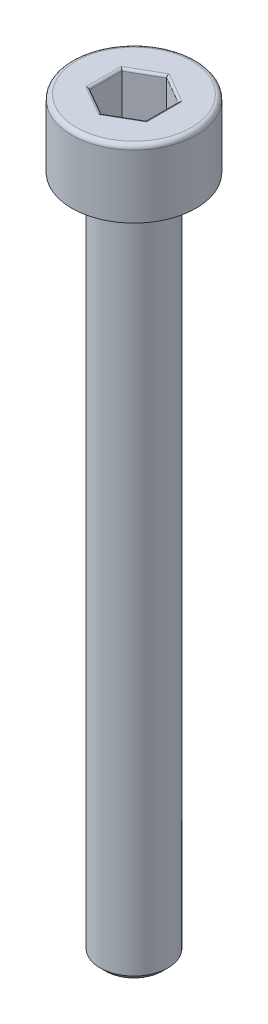
ISO-10303-21;
HEADER;
FILE_DESCRIPTION(('STEP AP214'),'2;1');
FILE_NAME('part.step','',(''),(''),'','','');
FILE_SCHEMA(('AUTOMOTIVE_DESIGN { 1 0 10303 214 1 1 1 1 }'));
ENDSEC;
DATA;
#1=APPLICATION_CONTEXT('core data for automotive mechanical design processes');
#2=APPLICATION_PROTOCOL_DEFINITION('international standard','automotive_design',2000,#1);
#3=PRODUCT_CONTEXT('',#1,'mechanical');
#4=PRODUCT('Part','Part','',(#3));
#5=PRODUCT_RELATED_PRODUCT_CATEGORY('part','',(#4));
#6=PRODUCT_DEFINITION_FORMATION('','',#4);
#7=PRODUCT_DEFINITION_CONTEXT('part definition',#1,'design');
#8=PRODUCT_DEFINITION('design','',#6,#7);
#9=PRODUCT_DEFINITION_SHAPE('','',#8);
#10=(LENGTH_UNIT() NAMED_UNIT(*) SI_UNIT(.MILLI.,.METRE.));
#11=(NAMED_UNIT(*) PLANE_ANGLE_UNIT() SI_UNIT($,.RADIAN.));
#12=(NAMED_UNIT(*) SI_UNIT($,.STERADIAN.) SOLID_ANGLE_UNIT());
#13=UNCERTAINTY_MEASURE_WITH_UNIT(LENGTH_MEASURE(1.E-05),#10,'distance_accuracy_value','');
#14=(GEOMETRIC_REPRESENTATION_CONTEXT(3) GLOBAL_UNCERTAINTY_ASSIGNED_CONTEXT((#13)) GLOBAL_UNIT_ASSIGNED_CONTEXT((#10,
#11,#12)) REPRESENTATION_CONTEXT('',''));
#15=CARTESIAN_POINT('',(0.,0.,0.));
#16=DIRECTION('',(0.,0.,1.));
#17=DIRECTION('',(1.,0.,0.));
#18=AXIS2_PLACEMENT_3D('',#15,#16,#17);
#19=CARTESIAN_POINT('',(0.,-33.,0.));
#20=DIRECTION('',(0.,-1.,0.));
#21=DIRECTION('',(0.,0.,-1.));
#22=AXIS2_PLACEMENT_3D('',#19,#20,#21);
#23=PLANE('',#22);
#24=CARTESIAN_POINT('',(0.,-33.,0.));
#25=DIRECTION('',(0.,-1.,0.));
#26=DIRECTION('',(0.,0.,-1.));
#27=AXIS2_PLACEMENT_3D('',#24,#25,#26);
#28=CIRCLE('',#27,1.24999999999999);
#29=CARTESIAN_POINT('',(0.,-33.,-1.24999999999999));
#30=VERTEX_POINT('',#29);
#31=EDGE_CURVE('E261',#30,#30,#28,.T.);
#32=ORIENTED_EDGE('',*,*,#31,.T.);
#33=EDGE_LOOP('',(#32));
#34=FACE_BOUND('',#33,.T.);
#35=ADVANCED_FACE('F33',(#34),#23,.T.);
#36=CARTESIAN_POINT('',(0.,0.,0.));
#37=DIRECTION('',(0.,1.,0.));
#38=DIRECTION('',(0.,0.,1.));
#39=AXIS2_PLACEMENT_3D('',#36,#37,#38);
#40=CYLINDRICAL_SURFACE('',#39,1.5);
#41=CARTESIAN_POINT('',(0.,-3.25,0.));
#42=DIRECTION('',(0.,-1.,0.));
#43=DIRECTION('',(0.,0.,-1.));
#44=AXIS2_PLACEMENT_3D('',#41,#42,#43);
#45=CIRCLE('',#44,1.5);
#46=CARTESIAN_POINT('',(0.,-3.25,-1.5));
#47=VERTEX_POINT('',#46);
#48=EDGE_CURVE('E258',#47,#47,#45,.T.);
#49=ORIENTED_EDGE('',*,*,#48,.T.);
#50=EDGE_LOOP('',(#49));
#51=FACE_BOUND('',#50,.T.);
#52=CARTESIAN_POINT('',(0.,-32.75,0.));
#53=DIRECTION('',(0.,-1.,0.));
#54=DIRECTION('',(0.,0.,-1.));
#55=AXIS2_PLACEMENT_3D('',#52,#53,#54);
#56=CIRCLE('',#55,1.5);
#57=CARTESIAN_POINT('',(0.,-32.75,-1.5));
#58=VERTEX_POINT('',#57);
#59=EDGE_CURVE('E255',#58,#58,#56,.F.);
#60=ORIENTED_EDGE('',*,*,#59,.T.);
#61=EDGE_LOOP('',(#60));
#62=FACE_BOUND('',#61,.T.);
#63=ADVANCED_FACE('F287',(#51,#62),#40,.T.);
#64=CARTESIAN_POINT('',(-1.5,-3.,0.));
#65=DIRECTION('',(0.,-1.,0.));
#66=DIRECTION('',(0.,0.,-1.));
#67=AXIS2_PLACEMENT_3D('',#64,#65,#66);
#68=PLANE('',#67);
#69=CARTESIAN_POINT('',(0.,-3.,0.));
#70=DIRECTION('',(0.,-1.,0.));
#71=DIRECTION('',(0.,0.,-1.));
#72=AXIS2_PLACEMENT_3D('',#69,#70,#71);
#73=CIRCLE('',#72,1.75);
#74=CARTESIAN_POINT('',(0.,-3.,-1.75));
#75=VERTEX_POINT('',#74);
#76=EDGE_CURVE('E252',#75,#75,#73,.F.);
#77=ORIENTED_EDGE('',*,*,#76,.T.);
#78=EDGE_LOOP('',(#77));
#79=FACE_BOUND('',#78,.T.);
#80=CARTESIAN_POINT('',(0.,-3.,0.));
#81=DIRECTION('',(0.,1.,0.));
#82=DIRECTION('',(0.,0.,1.));
#83=AXIS2_PLACEMENT_3D('',#80,#81,#82);
#84=CIRCLE('',#83,2.75);
#85=CARTESIAN_POINT('',(0.,-3.,2.75));
#86=VERTEX_POINT('',#85);
#87=EDGE_CURVE('E249',#86,#86,#84,.T.);
#88=ORIENTED_EDGE('',*,*,#87,.F.);
#89=EDGE_LOOP('',(#88));
#90=FACE_BOUND('',#89,.T.);
#91=ADVANCED_FACE('F293',(#79,#90),#68,.T.);
#92=CARTESIAN_POINT('',(0.,0.,0.));
#93=DIRECTION('',(0.,1.,0.));
#94=DIRECTION('',(0.,0.,1.));
#95=AXIS2_PLACEMENT_3D('',#92,#93,#94);
#96=CYLINDRICAL_SURFACE('',#95,2.75);
#97=CARTESIAN_POINT('',(0.,-0.2,0.));
#98=DIRECTION('',(0.,1.,0.));
#99=DIRECTION('',(0.,0.,1.));
#100=AXIS2_PLACEMENT_3D('',#97,#98,#99);
#101=CIRCLE('',#100,2.75);
#102=CARTESIAN_POINT('',(0.,-0.2,2.75));
#103=VERTEX_POINT('',#102);
#104=EDGE_CURVE('E159',#103,#103,#101,.F.);
#105=ORIENTED_EDGE('',*,*,#104,.T.);
#106=EDGE_LOOP('',(#105));
#107=FACE_BOUND('',#106,.T.);
#108=ORIENTED_EDGE('',*,*,#87,.T.);
#109=EDGE_LOOP('',(#108));
#110=FACE_BOUND('',#109,.T.);
#111=ADVANCED_FACE('F303',(#107,#110),#96,.T.);
#112=CARTESIAN_POINT('',(-2.75,0.,0.));
#113=DIRECTION('',(0.,1.,0.));
#114=DIRECTION('',(0.,0.,1.));
#115=AXIS2_PLACEMENT_3D('',#112,#113,#114);
#116=PLANE('',#115);
#117=DIRECTION('',(0.,0.,1.));
#118=VECTOR('',#117,1.);
#119=CARTESIAN_POINT('',(-1.35,0.,-0.721687836487033));
#120=LINE('',#119,#118);
#121=CARTESIAN_POINT('',(-1.35,0.,0.779422863405995));
#122=VERTEX_POINT('',#121);
#123=CARTESIAN_POINT('',(-1.35,0.,-0.779422863405995));
#124=VERTEX_POINT('',#123);
#125=EDGE_CURVE('E175',#122,#124,#120,.F.);
#126=ORIENTED_EDGE('',*,*,#125,.T.);
#127=DIRECTION('',(-0.866025403784439,0.,0.5));
#128=VECTOR('',#127,1.);
#129=CARTESIAN_POINT('',(-0.0500000000000002,0.,-1.52997821335251));
#130=LINE('',#129,#128);
#131=CARTESIAN_POINT('',(0.,0.,-1.55884572681199));
#132=VERTEX_POINT('',#131);
#133=EDGE_CURVE('E134',#124,#132,#130,.F.);
#134=ORIENTED_EDGE('',*,*,#133,.T.);
#135=DIRECTION('',(-0.866025403784439,0.,-0.5));
#136=VECTOR('',#135,1.);
#137=CARTESIAN_POINT('',(1.3,0.,-0.808290376865477));
#138=LINE('',#137,#136);
#139=CARTESIAN_POINT('',(1.35,0.,-0.779422863405995));
#140=VERTEX_POINT('',#139);
#141=EDGE_CURVE('E161',#132,#140,#138,.F.);
#142=ORIENTED_EDGE('',*,*,#141,.T.);
#143=DIRECTION('',(0.,0.,-1.));
#144=VECTOR('',#143,1.);
#145=CARTESIAN_POINT('',(1.35,0.,0.721687836487034));
#146=LINE('',#145,#144);
#147=CARTESIAN_POINT('',(1.35,0.,0.779422863405996));
#148=VERTEX_POINT('',#147);
#149=EDGE_CURVE('E169',#140,#148,#146,.F.);
#150=ORIENTED_EDGE('',*,*,#149,.T.);
#151=DIRECTION('',(0.866025403784439,0.,-0.5));
#152=VECTOR('',#151,1.);
#153=CARTESIAN_POINT('',(0.05,0.,1.52997821335251));
#154=LINE('',#153,#152);
#155=CARTESIAN_POINT('',(0.,0.,1.55884572681199));
#156=VERTEX_POINT('',#155);
#157=EDGE_CURVE('E171',#148,#156,#154,.F.);
#158=ORIENTED_EDGE('',*,*,#157,.T.);
#159=DIRECTION('',(0.866025403784438,0.,0.5));
#160=VECTOR('',#159,1.);
#161=CARTESIAN_POINT('',(-1.3,0.,0.808290376865476));
#162=LINE('',#161,#160);
#163=EDGE_CURVE('E173',#156,#122,#162,.F.);
#164=ORIENTED_EDGE('',*,*,#163,.T.);
#165=EDGE_LOOP('',(#126,#134,#142,#150,#158,#164));
#166=FACE_BOUND('',#165,.T.);
#167=CARTESIAN_POINT('',(0.,0.,0.));
#168=DIRECTION('',(0.,1.,0.));
#169=DIRECTION('',(0.,0.,1.));
#170=AXIS2_PLACEMENT_3D('',#167,#168,#169);
#171=CIRCLE('',#170,2.55);
#172=CARTESIAN_POINT('',(0.,0.,2.55));
#173=VERTEX_POINT('',#172);
#174=EDGE_CURVE('E164',#173,#173,#171,.T.);
#175=ORIENTED_EDGE('',*,*,#174,.T.);
#176=EDGE_LOOP('',(#175));
#177=FACE_BOUND('',#176,.T.);
#178=ADVANCED_FACE('F266',(#166,#177),#116,.T.);
#179=CARTESIAN_POINT('',(0.,-3.,0.));
#180=DIRECTION('',(0.,1.,0.));
#181=DIRECTION('',(0.,0.,1.));
#182=AXIS2_PLACEMENT_3D('',#179,#180,#181);
#183=CONICAL_SURFACE('',#182,1.75,0.785398163397445);
#184=ORIENTED_EDGE('',*,*,#48,.F.);
#185=EDGE_LOOP('',(#184));
#186=FACE_BOUND('',#185,.T.);
#187=ORIENTED_EDGE('',*,*,#76,.F.);
#188=EDGE_LOOP('',(#187));
#189=FACE_BOUND('',#188,.T.);
#190=ADVANCED_FACE('F281',(#186,#189),#183,.T.);
#191=CARTESIAN_POINT('',(0.,-32.75,0.));
#192=DIRECTION('',(0.,1.,0.));
#193=DIRECTION('',(0.,0.,1.));
#194=AXIS2_PLACEMENT_3D('',#191,#192,#193);
#195=CONICAL_SURFACE('',#194,1.5,0.785398163397458);
#196=ORIENTED_EDGE('',*,*,#31,.F.);
#197=EDGE_LOOP('',(#196));
#198=FACE_BOUND('',#197,.T.);
#199=ORIENTED_EDGE('',*,*,#59,.F.);
#200=EDGE_LOOP('',(#199));
#201=FACE_BOUND('',#200,.T.);
#202=ADVANCED_FACE('F271',(#198,#201),#195,.T.);
#203=CARTESIAN_POINT('',(0.,-0.2,0.));
#204=DIRECTION('',(0.,1.,0.));
#205=DIRECTION('',(0.,0.,1.));
#206=AXIS2_PLACEMENT_3D('',#203,#204,#205);
#207=TOROIDAL_SURFACE('',#206,2.55,0.2);
#208=ORIENTED_EDGE('',*,*,#104,.F.);
#209=EDGE_LOOP('',(#208));
#210=FACE_BOUND('',#209,.T.);
#211=ORIENTED_EDGE('',*,*,#174,.F.);
#212=EDGE_LOOP('',(#211));
#213=FACE_BOUND('',#212,.T.);
#214=ADVANCED_FACE('F268',(#210,#213),#207,.T.);
#215=CARTESIAN_POINT('',(1.25,-2.,-0.721687836487033));
#216=DIRECTION('',(0.5,0.,-0.866025403784439));
#217=DIRECTION('',(-0.866025403784439,0.,-0.5));
#218=AXIS2_PLACEMENT_3D('',#215,#216,#217);
#219=PLANE('',#218);
#220=DIRECTION('',(0.,1.,0.));
#221=VECTOR('',#220,1.);
#222=CARTESIAN_POINT('',(1.25,-2.,-0.721687836487033));
#223=LINE('',#222,#221);
#224=CARTESIAN_POINT('',(1.25,-1.9,-0.721687836487033));
#225=VERTEX_POINT('',#224);
#226=CARTESIAN_POINT('',(1.25,-0.1,-0.721687836487033));
#227=VERTEX_POINT('',#226);
#228=EDGE_CURVE('E243',#225,#227,#223,.T.);
#229=ORIENTED_EDGE('',*,*,#228,.T.);
#230=DIRECTION('',(-0.866025403784439,0.,-0.5));
#231=VECTOR('',#230,1.);
#232=CARTESIAN_POINT('',(0.,-0.1,-1.44337567297406));
#233=LINE('',#232,#231);
#234=CARTESIAN_POINT('',(0.,-0.1,-1.44337567297406));
#235=VERTEX_POINT('',#234);
#236=EDGE_CURVE('E195',#227,#235,#233,.T.);
#237=ORIENTED_EDGE('',*,*,#236,.T.);
#238=DIRECTION('',(0.,1.,0.));
#239=VECTOR('',#238,1.);
#240=CARTESIAN_POINT('',(0.,-2.,-1.44337567297406));
#241=LINE('',#240,#239);
#242=CARTESIAN_POINT('',(0.,-1.9,-1.44337567297406));
#243=VERTEX_POINT('',#242);
#244=EDGE_CURVE('E145',#243,#235,#241,.T.);
#245=ORIENTED_EDGE('',*,*,#244,.F.);
#246=DIRECTION('',(-0.866025403784439,0.,-0.5));
#247=VECTOR('',#246,1.);
#248=CARTESIAN_POINT('',(1.25,-1.9,-0.721687836487033));
#249=LINE('',#248,#247);
#250=EDGE_CURVE('E193',#243,#225,#249,.F.);
#251=ORIENTED_EDGE('',*,*,#250,.T.);
#252=EDGE_LOOP('',(#229,#237,#245,#251));
#253=FACE_BOUND('',#252,.T.);
#254=ADVANCED_FACE('F270',(#253),#219,.F.);
#255=CARTESIAN_POINT('',(1.25,-2.,0.721687836487034));
#256=DIRECTION('',(1.,0.,0.));
#257=DIRECTION('',(0.,0.,-1.));
#258=AXIS2_PLACEMENT_3D('',#255,#256,#257);
#259=PLANE('',#258);
#260=DIRECTION('',(0.,1.,0.));
#261=VECTOR('',#260,1.);
#262=CARTESIAN_POINT('',(1.25,-2.,0.721687836487034));
#263=LINE('',#262,#261);
#264=CARTESIAN_POINT('',(1.25,-1.9,0.721687836487034));
#265=VERTEX_POINT('',#264);
#266=CARTESIAN_POINT('',(1.25,-0.1,0.721687836487034));
#267=VERTEX_POINT('',#266);
#268=EDGE_CURVE('E240',#265,#267,#263,.T.);
#269=ORIENTED_EDGE('',*,*,#268,.T.);
#270=DIRECTION('',(0.,0.,-1.));
#271=VECTOR('',#270,1.);
#272=CARTESIAN_POINT('',(1.25,-0.1,-0.721687836487033));
#273=LINE('',#272,#271);
#274=EDGE_CURVE('E191',#267,#227,#273,.T.);
#275=ORIENTED_EDGE('',*,*,#274,.T.);
#276=ORIENTED_EDGE('',*,*,#228,.F.);
#277=DIRECTION('',(0.,0.,-1.));
#278=VECTOR('',#277,1.);
#279=CARTESIAN_POINT('',(1.25,-1.9,0.721687836487034));
#280=LINE('',#279,#278);
#281=EDGE_CURVE('E188',#225,#265,#280,.F.);
#282=ORIENTED_EDGE('',*,*,#281,.T.);
#283=EDGE_LOOP('',(#269,#275,#276,#282));
#284=FACE_BOUND('',#283,.T.);
#285=ADVANCED_FACE('F278',(#284),#259,.F.);
#286=CARTESIAN_POINT('',(0.,-2.,1.44337567297407));
#287=DIRECTION('',(0.5,0.,0.866025403784439));
#288=DIRECTION('',(0.866025403784439,0.,-0.5));
#289=AXIS2_PLACEMENT_3D('',#286,#287,#288);
#290=PLANE('',#289);
#291=DIRECTION('',(0.,1.,0.));
#292=VECTOR('',#291,1.);
#293=CARTESIAN_POINT('',(0.,-2.,1.44337567297407));
#294=LINE('',#293,#292);
#295=CARTESIAN_POINT('',(0.,-1.9,1.44337567297407));
#296=VERTEX_POINT('',#295);
#297=CARTESIAN_POINT('',(0.,-0.1,1.44337567297407));
#298=VERTEX_POINT('',#297);
#299=EDGE_CURVE('E237',#296,#298,#294,.T.);
#300=ORIENTED_EDGE('',*,*,#299,.T.);
#301=DIRECTION('',(0.866025403784439,0.,-0.5));
#302=VECTOR('',#301,1.);
#303=CARTESIAN_POINT('',(1.25,-0.1,0.721687836487034));
#304=LINE('',#303,#302);
#305=EDGE_CURVE('E186',#298,#267,#304,.T.);
#306=ORIENTED_EDGE('',*,*,#305,.T.);
#307=ORIENTED_EDGE('',*,*,#268,.F.);
#308=DIRECTION('',(0.866025403784439,0.,-0.5));
#309=VECTOR('',#308,1.);
#310=CARTESIAN_POINT('',(0.,-1.9,1.44337567297407));
#311=LINE('',#310,#309);
#312=EDGE_CURVE('E184',#265,#296,#311,.F.);
#313=ORIENTED_EDGE('',*,*,#312,.T.);
#314=EDGE_LOOP('',(#300,#306,#307,#313));
#315=FACE_BOUND('',#314,.T.);
#316=ADVANCED_FACE('F327',(#315),#290,.F.);
#317=CARTESIAN_POINT('',(-1.25,-2.,0.721687836487033));
#318=DIRECTION('',(-0.5,0.,0.866025403784439));
#319=DIRECTION('',(0.866025403784438,0.,0.5));
#320=AXIS2_PLACEMENT_3D('',#317,#318,#319);
#321=PLANE('',#320);
#322=DIRECTION('',(0.,1.,0.));
#323=VECTOR('',#322,1.);
#324=CARTESIAN_POINT('',(-1.25,-2.,0.721687836487033));
#325=LINE('',#324,#323);
#326=CARTESIAN_POINT('',(-1.25,-1.9,0.721687836487033));
#327=VERTEX_POINT('',#326);
#328=CARTESIAN_POINT('',(-1.25,-0.1,0.721687836487033));
#329=VERTEX_POINT('',#328);
#330=EDGE_CURVE('E128',#327,#329,#325,.T.);
#331=ORIENTED_EDGE('',*,*,#330,.T.);
#332=DIRECTION('',(0.866025403784438,0.,0.5));
#333=VECTOR('',#332,1.);
#334=CARTESIAN_POINT('',(0.,-0.1,1.44337567297407));
#335=LINE('',#334,#333);
#336=EDGE_CURVE('E182',#329,#298,#335,.T.);
#337=ORIENTED_EDGE('',*,*,#336,.T.);
#338=ORIENTED_EDGE('',*,*,#299,.F.);
#339=DIRECTION('',(0.866025403784438,0.,0.5));
#340=VECTOR('',#339,1.);
#341=CARTESIAN_POINT('',(-1.25,-1.9,0.721687836487033));
#342=LINE('',#341,#340);
#343=EDGE_CURVE('E180',#296,#327,#342,.F.);
#344=ORIENTED_EDGE('',*,*,#343,.T.);
#345=EDGE_LOOP('',(#331,#337,#338,#344));
#346=FACE_BOUND('',#345,.T.);
#347=ADVANCED_FACE('F234',(#346),#321,.F.);
#348=CARTESIAN_POINT('',(-1.25,-2.,-0.721687836487033));
#349=DIRECTION('',(-1.,0.,0.));
#350=DIRECTION('',(0.,0.,1.));
#351=AXIS2_PLACEMENT_3D('',#348,#349,#350);
#352=PLANE('',#351);
#353=DIRECTION('',(0.,1.,0.));
#354=VECTOR('',#353,1.);
#355=CARTESIAN_POINT('',(-1.25,-2.,-0.721687836487033));
#356=LINE('',#355,#354);
#357=CARTESIAN_POINT('',(-1.25,-1.9,-0.721687836487033));
#358=VERTEX_POINT('',#357);
#359=CARTESIAN_POINT('',(-1.25,-0.1,-0.721687836487033));
#360=VERTEX_POINT('',#359);
#361=EDGE_CURVE('E126',#358,#360,#356,.T.);
#362=ORIENTED_EDGE('',*,*,#361,.T.);
#363=DIRECTION('',(0.,0.,1.));
#364=VECTOR('',#363,1.);
#365=CARTESIAN_POINT('',(-1.25,-0.1,0.721687836487033));
#366=LINE('',#365,#364);
#367=EDGE_CURVE('E133',#360,#329,#366,.T.);
#368=ORIENTED_EDGE('',*,*,#367,.T.);
#369=ORIENTED_EDGE('',*,*,#330,.F.);
#370=DIRECTION('',(0.,0.,1.));
#371=VECTOR('',#370,1.);
#372=CARTESIAN_POINT('',(-1.25,-1.9,-0.721687836487033));
#373=LINE('',#372,#371);
#374=EDGE_CURVE('E123',#327,#358,#373,.F.);
#375=ORIENTED_EDGE('',*,*,#374,.T.);
#376=EDGE_LOOP('',(#362,#368,#369,#375));
#377=FACE_BOUND('',#376,.T.);
#378=ADVANCED_FACE('F125',(#377),#352,.F.);
#379=CARTESIAN_POINT('',(0.,-2.,-1.44337567297406));
#380=DIRECTION('',(-0.5,0.,-0.866025403784439));
#381=DIRECTION('',(-0.866025403784439,0.,0.5));
#382=AXIS2_PLACEMENT_3D('',#379,#380,#381);
#383=PLANE('',#382);
#384=ORIENTED_EDGE('',*,*,#244,.T.);
#385=DIRECTION('',(-0.866025403784439,0.,0.5));
#386=VECTOR('',#385,1.);
#387=CARTESIAN_POINT('',(-1.25,-0.1,-0.721687836487032));
#388=LINE('',#387,#386);
#389=EDGE_CURVE('E144',#235,#360,#388,.T.);
#390=ORIENTED_EDGE('',*,*,#389,.T.);
#391=ORIENTED_EDGE('',*,*,#361,.F.);
#392=DIRECTION('',(-0.866025403784439,0.,0.5));
#393=VECTOR('',#392,1.);
#394=CARTESIAN_POINT('',(0.,-1.9,-1.44337567297406));
#395=LINE('',#394,#393);
#396=EDGE_CURVE('E141',#358,#243,#395,.F.);
#397=ORIENTED_EDGE('',*,*,#396,.T.);
#398=EDGE_LOOP('',(#384,#390,#391,#397));
#399=FACE_BOUND('',#398,.T.);
#400=ADVANCED_FACE('F139',(#399),#383,.F.);
#401=CARTESIAN_POINT('',(1.25,-2.,-0.721687836487033));
#402=DIRECTION('',(0.,-1.,0.));
#403=DIRECTION('',(0.,0.,-1.));
#404=AXIS2_PLACEMENT_3D('',#401,#402,#403);
#405=PLANE('',#404);
#406=DIRECTION('',(0.866025403784439,0.,-0.5));
#407=VECTOR('',#406,1.);
#408=CARTESIAN_POINT('',(1.2,-2.,0.63508529610859));
#409=LINE('',#408,#407);
#410=CARTESIAN_POINT('',(0.,-2.,1.32790561913614));
#411=VERTEX_POINT('',#410);
#412=CARTESIAN_POINT('',(1.15,-2.,0.663952809568071));
#413=VERTEX_POINT('',#412);
#414=EDGE_CURVE('E42',#411,#413,#409,.T.);
#415=ORIENTED_EDGE('',*,*,#414,.T.);
#416=DIRECTION('',(0.,0.,-1.));
#417=VECTOR('',#416,1.);
#418=CARTESIAN_POINT('',(1.15,-2.,-0.721687836487033));
#419=LINE('',#418,#417);
#420=CARTESIAN_POINT('',(1.15,-2.,-0.66395280956807));
#421=VERTEX_POINT('',#420);
#422=EDGE_CURVE('E11',#413,#421,#419,.T.);
#423=ORIENTED_EDGE('',*,*,#422,.T.);
#424=DIRECTION('',(-0.866025403784439,0.,-0.5));
#425=VECTOR('',#424,1.);
#426=CARTESIAN_POINT('',(-0.0500000000000001,-2.,-1.35677313259562));
#427=LINE('',#426,#425);
#428=CARTESIAN_POINT('',(0.,-2.,-1.32790561913614));
#429=VERTEX_POINT('',#428);
#430=EDGE_CURVE('E197',#421,#429,#427,.T.);
#431=ORIENTED_EDGE('',*,*,#430,.T.);
#432=DIRECTION('',(-0.866025403784439,0.,0.5));
#433=VECTOR('',#432,1.);
#434=CARTESIAN_POINT('',(-1.2,-2.,-0.635085296108588));
#435=LINE('',#434,#433);
#436=CARTESIAN_POINT('',(-1.15,-2.,-0.66395280956807));
#437=VERTEX_POINT('',#436);
#438=EDGE_CURVE('E199',#429,#437,#435,.T.);
#439=ORIENTED_EDGE('',*,*,#438,.T.);
#440=DIRECTION('',(0.,0.,1.));
#441=VECTOR('',#440,1.);
#442=CARTESIAN_POINT('',(-1.15,-2.,0.721687836487033));
#443=LINE('',#442,#441);
#444=CARTESIAN_POINT('',(-1.15,-2.,0.66395280956807));
#445=VERTEX_POINT('',#444);
#446=EDGE_CURVE('E150',#437,#445,#443,.T.);
#447=ORIENTED_EDGE('',*,*,#446,.T.);
#448=DIRECTION('',(0.866025403784438,0.,0.5));
#449=VECTOR('',#448,1.);
#450=CARTESIAN_POINT('',(0.0499999999999999,-2.,1.35677313259562));
#451=LINE('',#450,#449);
#452=EDGE_CURVE('E53',#445,#411,#451,.T.);
#453=ORIENTED_EDGE('',*,*,#452,.T.);
#454=EDGE_LOOP('',(#415,#423,#431,#439,#447,#453));
#455=FACE_BOUND('',#454,.T.);
#456=ADVANCED_FACE('F322',(#455),#405,.F.);
#457=CARTESIAN_POINT('',(0.05,-0.1,1.52997821335251));
#458=DIRECTION('',(-0.866025403784439,0.,0.5));
#459=DIRECTION('',(0.5,0.,0.866025403784439));
#460=AXIS2_PLACEMENT_3D('',#457,#458,#459);
#461=CYLINDRICAL_SURFACE('',#460,0.1);
#462=CARTESIAN_POINT('',(0.,-0.1,1.55884572681199));
#463=DIRECTION('',(-1.,0.,0.));
#464=DIRECTION('',(0.,0.,-1.));
#465=AXIS2_PLACEMENT_3D('',#462,#463,#464);
#466=ELLIPSE('',#465,0.115470053837925,0.1);
#467=EDGE_CURVE('E214',#156,#298,#466,.T.);
#468=ORIENTED_EDGE('',*,*,#467,.F.);
#469=ORIENTED_EDGE('',*,*,#157,.F.);
#470=CARTESIAN_POINT('',(1.35,-0.1,0.779422863405997));
#471=DIRECTION('',(-0.5,0.,0.866025403784438));
#472=DIRECTION('',(-0.866025403784438,0.,-0.5));
#473=AXIS2_PLACEMENT_3D('',#470,#471,#472);
#474=ELLIPSE('',#473,0.115470053837925,0.1);
#475=EDGE_CURVE('E217',#267,#148,#474,.F.);
#476=ORIENTED_EDGE('',*,*,#475,.F.);
#477=ORIENTED_EDGE('',*,*,#305,.F.);
#478=EDGE_LOOP('',(#468,#469,#476,#477));
#479=FACE_BOUND('',#478,.T.);
#480=ADVANCED_FACE('F334',(#479),#461,.T.);
#481=CARTESIAN_POINT('',(1.35,-0.1,0.721687836487034));
#482=DIRECTION('',(0.,0.,1.));
#483=DIRECTION('',(1.,0.,0.));
#484=AXIS2_PLACEMENT_3D('',#481,#482,#483);
#485=CYLINDRICAL_SURFACE('',#484,0.1);
#486=ORIENTED_EDGE('',*,*,#475,.T.);
#487=ORIENTED_EDGE('',*,*,#149,.F.);
#488=CARTESIAN_POINT('',(1.35,-0.1,-0.779422863405995));
#489=DIRECTION('',(0.5,0.,0.866025403784439));
#490=DIRECTION('',(-0.866025403784439,0.,0.5));
#491=AXIS2_PLACEMENT_3D('',#488,#489,#490);
#492=ELLIPSE('',#491,0.115470053837925,0.1);
#493=EDGE_CURVE('E211',#227,#140,#492,.F.);
#494=ORIENTED_EDGE('',*,*,#493,.F.);
#495=ORIENTED_EDGE('',*,*,#274,.F.);
#496=EDGE_LOOP('',(#486,#487,#494,#495));
#497=FACE_BOUND('',#496,.T.);
#498=ADVANCED_FACE('F338',(#497),#485,.T.);
#499=CARTESIAN_POINT('',(-1.3,-0.1,0.808290376865476));
#500=DIRECTION('',(-0.866025403784438,0.,-0.5));
#501=DIRECTION('',(-0.5,0.,0.866025403784439));
#502=AXIS2_PLACEMENT_3D('',#499,#500,#501);
#503=CYLINDRICAL_SURFACE('',#502,0.1);
#504=ORIENTED_EDGE('',*,*,#467,.T.);
#505=ORIENTED_EDGE('',*,*,#336,.F.);
#506=CARTESIAN_POINT('',(-1.35,-0.1,0.779422863405995));
#507=DIRECTION('',(-0.5,0.,-0.866025403784439));
#508=DIRECTION('',(0.866025403784439,0.,-0.5));
#509=AXIS2_PLACEMENT_3D('',#506,#507,#508);
#510=ELLIPSE('',#509,0.115470053837925,0.1);
#511=EDGE_CURVE('E208',#122,#329,#510,.T.);
#512=ORIENTED_EDGE('',*,*,#511,.F.);
#513=ORIENTED_EDGE('',*,*,#163,.F.);
#514=EDGE_LOOP('',(#504,#505,#512,#513));
#515=FACE_BOUND('',#514,.T.);
#516=ADVANCED_FACE('F344',(#515),#503,.T.);
#517=CARTESIAN_POINT('',(1.3,-0.1,-0.808290376865477));
#518=DIRECTION('',(0.866025403784439,0.,0.5));
#519=DIRECTION('',(0.5,0.,-0.866025403784439));
#520=AXIS2_PLACEMENT_3D('',#517,#518,#519);
#521=CYLINDRICAL_SURFACE('',#520,0.1);
#522=ORIENTED_EDGE('',*,*,#493,.T.);
#523=ORIENTED_EDGE('',*,*,#141,.F.);
#524=CARTESIAN_POINT('',(0.,-0.1,-1.55884572681199));
#525=DIRECTION('',(1.,0.,0.));
#526=DIRECTION('',(0.,0.,-1.));
#527=AXIS2_PLACEMENT_3D('',#524,#525,#526);
#528=ELLIPSE('',#527,0.115470053837925,0.1);
#529=EDGE_CURVE('E206',#235,#132,#528,.F.);
#530=ORIENTED_EDGE('',*,*,#529,.F.);
#531=ORIENTED_EDGE('',*,*,#236,.F.);
#532=EDGE_LOOP('',(#522,#523,#530,#531));
#533=FACE_BOUND('',#532,.T.);
#534=ADVANCED_FACE('F374',(#533),#521,.T.);
#535=CARTESIAN_POINT('',(-1.35,-0.1,-0.721687836487033));
#536=DIRECTION('',(0.,0.,-1.));
#537=DIRECTION('',(-1.,0.,0.));
#538=AXIS2_PLACEMENT_3D('',#535,#536,#537);
#539=CYLINDRICAL_SURFACE('',#538,0.1);
#540=ORIENTED_EDGE('',*,*,#511,.T.);
#541=ORIENTED_EDGE('',*,*,#367,.F.);
#542=CARTESIAN_POINT('',(-1.35,-0.1,-0.779422863405995));
#543=DIRECTION('',(0.5,0.,-0.866025403784439));
#544=DIRECTION('',(0.866025403784439,0.,0.5));
#545=AXIS2_PLACEMENT_3D('',#542,#543,#544);
#546=ELLIPSE('',#545,0.115470053837925,0.1);
#547=EDGE_CURVE('E204',#124,#360,#546,.T.);
#548=ORIENTED_EDGE('',*,*,#547,.F.);
#549=ORIENTED_EDGE('',*,*,#125,.F.);
#550=EDGE_LOOP('',(#540,#541,#548,#549));
#551=FACE_BOUND('',#550,.T.);
#552=ADVANCED_FACE('F369',(#551),#539,.T.);
#553=CARTESIAN_POINT('',(-0.05,-0.1,-1.52997821335251));
#554=DIRECTION('',(0.866025403784439,0.,-0.5));
#555=DIRECTION('',(-0.5,0.,-0.866025403784439));
#556=AXIS2_PLACEMENT_3D('',#553,#554,#555);
#557=CYLINDRICAL_SURFACE('',#556,0.1);
#558=ORIENTED_EDGE('',*,*,#529,.T.);
#559=ORIENTED_EDGE('',*,*,#133,.F.);
#560=ORIENTED_EDGE('',*,*,#547,.T.);
#561=ORIENTED_EDGE('',*,*,#389,.F.);
#562=EDGE_LOOP('',(#558,#559,#560,#561));
#563=FACE_BOUND('',#562,.T.);
#564=ADVANCED_FACE('F365',(#563),#557,.T.);
#565=CARTESIAN_POINT('',(-1.15,-1.9,-0.721687836487033));
#566=DIRECTION('',(0.,0.,-1.));
#567=DIRECTION('',(-1.,0.,0.));
#568=AXIS2_PLACEMENT_3D('',#565,#566,#567);
#569=CYLINDRICAL_SURFACE('',#568,0.1);
#570=CARTESIAN_POINT('',(-1.15,-1.9,-0.663952809568069));
#571=DIRECTION('',(0.5,0.,-0.866025403784439));
#572=DIRECTION('',(-0.866025403784439,0.,-0.5));
#573=AXIS2_PLACEMENT_3D('',#570,#571,#572);
#574=ELLIPSE('',#573,0.115470053837925,0.1);
#575=EDGE_CURVE('E149',#358,#437,#574,.F.);
#576=ORIENTED_EDGE('',*,*,#575,.F.);
#577=ORIENTED_EDGE('',*,*,#374,.F.);
#578=CARTESIAN_POINT('',(-1.15,-1.9,0.66395280956807));
#579=DIRECTION('',(-0.5,0.,-0.866025403784439));
#580=DIRECTION('',(-0.866025403784439,0.,0.5));
#581=AXIS2_PLACEMENT_3D('',#578,#579,#580);
#582=ELLIPSE('',#581,0.115470053837925,0.1);
#583=EDGE_CURVE('E37',#445,#327,#582,.T.);
#584=ORIENTED_EDGE('',*,*,#583,.F.);
#585=ORIENTED_EDGE('',*,*,#446,.F.);
#586=EDGE_LOOP('',(#576,#577,#584,#585));
#587=FACE_BOUND('',#586,.T.);
#588=ADVANCED_FACE('F35',(#587),#569,.F.);
#589=CARTESIAN_POINT('',(0.0499999999999988,-1.9,1.35677313259562));
#590=DIRECTION('',(-0.866025403784438,0.,-0.5));
#591=DIRECTION('',(-0.5,0.,0.866025403784439));
#592=AXIS2_PLACEMENT_3D('',#589,#590,#591);
#593=CYLINDRICAL_SURFACE('',#592,0.1);
#594=ORIENTED_EDGE('',*,*,#583,.T.);
#595=ORIENTED_EDGE('',*,*,#343,.F.);
#596=CARTESIAN_POINT('',(0.,-1.9,1.32790561913614));
#597=DIRECTION('',(-1.,0.,0.));
#598=DIRECTION('',(0.,0.,1.));
#599=AXIS2_PLACEMENT_3D('',#596,#597,#598);
#600=ELLIPSE('',#599,0.115470053837925,0.1);
#601=EDGE_CURVE('E153',#411,#296,#600,.T.);
#602=ORIENTED_EDGE('',*,*,#601,.F.);
#603=ORIENTED_EDGE('',*,*,#452,.F.);
#604=EDGE_LOOP('',(#594,#595,#602,#603));
#605=FACE_BOUND('',#604,.T.);
#606=ADVANCED_FACE('F231',(#605),#593,.F.);
#607=CARTESIAN_POINT('',(0.675,-1.9,-1.71761705083914));
#608=DIRECTION('',(0.866025403784439,0.,-0.5));
#609=DIRECTION('',(-0.5,0.,-0.866025403784439));
#610=AXIS2_PLACEMENT_3D('',#607,#608,#609);
#611=CYLINDRICAL_SURFACE('',#610,0.1);
#612=ORIENTED_EDGE('',*,*,#575,.T.);
#613=ORIENTED_EDGE('',*,*,#438,.F.);
#614=CARTESIAN_POINT('',(0.,-1.9,-1.32790561913614));
#615=DIRECTION('',(1.,0.,0.));
#616=DIRECTION('',(0.,0.,-1.));
#617=AXIS2_PLACEMENT_3D('',#614,#615,#616);
#618=ELLIPSE('',#617,0.115470053837925,0.1);
#619=EDGE_CURVE('E157',#243,#429,#618,.F.);
#620=ORIENTED_EDGE('',*,*,#619,.F.);
#621=ORIENTED_EDGE('',*,*,#396,.F.);
#622=EDGE_LOOP('',(#612,#613,#620,#621));
#623=FACE_BOUND('',#622,.T.);
#624=ADVANCED_FACE('F155',(#623),#611,.F.);
#625=CARTESIAN_POINT('',(1.825,-1.9,0.274241377865074));
#626=DIRECTION('',(-0.866025403784439,0.,0.5));
#627=DIRECTION('',(0.5,0.,0.866025403784439));
#628=AXIS2_PLACEMENT_3D('',#625,#626,#627);
#629=CYLINDRICAL_SURFACE('',#628,0.1);
#630=ORIENTED_EDGE('',*,*,#601,.T.);
#631=ORIENTED_EDGE('',*,*,#312,.F.);
#632=CARTESIAN_POINT('',(1.15,-1.9,0.663952809568072));
#633=DIRECTION('',(-0.5,0.,0.866025403784438));
#634=DIRECTION('',(0.866025403784438,0.,0.5));
#635=AXIS2_PLACEMENT_3D('',#632,#633,#634);
#636=ELLIPSE('',#635,0.115470053837925,0.1);
#637=EDGE_CURVE('E222',#413,#265,#636,.T.);
#638=ORIENTED_EDGE('',*,*,#637,.F.);
#639=ORIENTED_EDGE('',*,*,#414,.F.);
#640=EDGE_LOOP('',(#630,#631,#638,#639));
#641=FACE_BOUND('',#640,.T.);
#642=ADVANCED_FACE('F228',(#641),#629,.F.);
#643=CARTESIAN_POINT('',(1.2,-1.9,-0.635085296108589));
#644=DIRECTION('',(0.866025403784439,0.,0.5));
#645=DIRECTION('',(0.5,0.,-0.866025403784439));
#646=AXIS2_PLACEMENT_3D('',#643,#644,#645);
#647=CYLINDRICAL_SURFACE('',#646,0.1);
#648=ORIENTED_EDGE('',*,*,#619,.T.);
#649=ORIENTED_EDGE('',*,*,#430,.F.);
#650=CARTESIAN_POINT('',(1.15,-1.9,-0.66395280956807));
#651=DIRECTION('',(0.5,0.,0.866025403784439));
#652=DIRECTION('',(-0.866025403784439,0.,0.5));
#653=AXIS2_PLACEMENT_3D('',#650,#651,#652);
#654=ELLIPSE('',#653,0.115470053837925,0.1);
#655=EDGE_CURVE('E220',#225,#421,#654,.F.);
#656=ORIENTED_EDGE('',*,*,#655,.F.);
#657=ORIENTED_EDGE('',*,*,#250,.F.);
#658=EDGE_LOOP('',(#648,#649,#656,#657));
#659=FACE_BOUND('',#658,.T.);
#660=ADVANCED_FACE('F353',(#659),#647,.F.);
#661=CARTESIAN_POINT('',(1.15,-1.9,-0.721687836487033));
#662=DIRECTION('',(0.,0.,1.));
#663=DIRECTION('',(1.,0.,0.));
#664=AXIS2_PLACEMENT_3D('',#661,#662,#663);
#665=CYLINDRICAL_SURFACE('',#664,0.1);
#666=ORIENTED_EDGE('',*,*,#637,.T.);
#667=ORIENTED_EDGE('',*,*,#281,.F.);
#668=ORIENTED_EDGE('',*,*,#655,.T.);
#669=ORIENTED_EDGE('',*,*,#422,.F.);
#670=EDGE_LOOP('',(#666,#667,#668,#669));
#671=FACE_BOUND('',#670,.T.);
#672=ADVANCED_FACE('F350',(#671),#665,.F.);
#673=CLOSED_SHELL('',(#35,#63,#91,#111,#178,#190,#202,#214,#254,#285,#316,#347,#378,#400,#456,
#480,#498,#516,#534,#552,#564,#588,#606,#624,#642,#660,#672));
#674=MANIFOLD_SOLID_BREP('B2',#673);
#675=ADVANCED_BREP_SHAPE_REPRESENTATION('',(#18,#674),#14);
#676=SHAPE_DEFINITION_REPRESENTATION(#9,#675);
ENDSEC;
END-ISO-10303-21;
